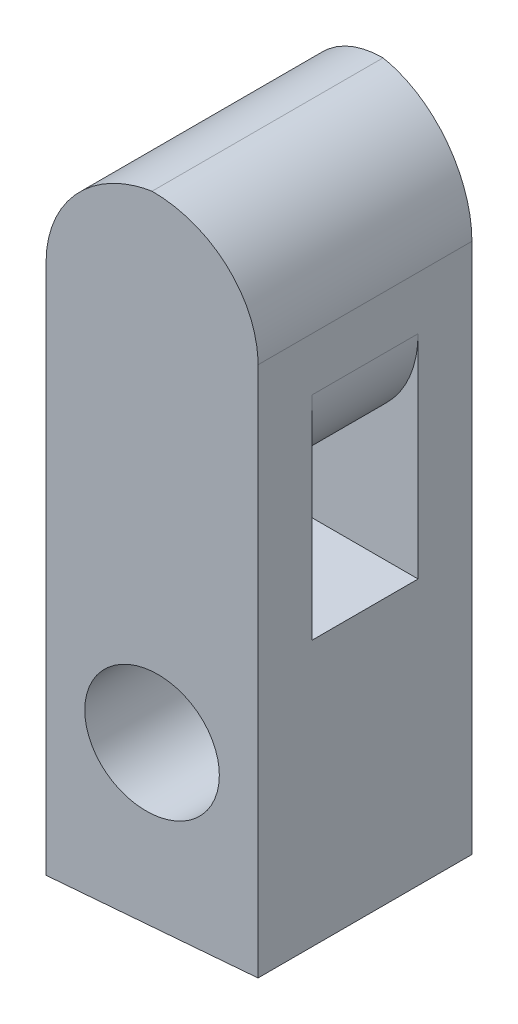
ISO-10303-21;
HEADER;
FILE_DESCRIPTION(('STEP AP214'),'2;1');
FILE_NAME('part.step','',(''),(''),'','','');
FILE_SCHEMA(('AUTOMOTIVE_DESIGN { 1 0 10303 214 1 1 1 1 }'));
ENDSEC;
DATA;
#1=APPLICATION_CONTEXT('core data for automotive mechanical design processes');
#2=APPLICATION_PROTOCOL_DEFINITION('international standard','automotive_design',2000,#1);
#3=PRODUCT_CONTEXT('',#1,'mechanical');
#4=PRODUCT('Part','Part','',(#3));
#5=PRODUCT_RELATED_PRODUCT_CATEGORY('part','',(#4));
#6=PRODUCT_DEFINITION_FORMATION('','',#4);
#7=PRODUCT_DEFINITION_CONTEXT('part definition',#1,'design');
#8=PRODUCT_DEFINITION('design','',#6,#7);
#9=PRODUCT_DEFINITION_SHAPE('','',#8);
#10=(LENGTH_UNIT() NAMED_UNIT(*) SI_UNIT(.MILLI.,.METRE.));
#11=(NAMED_UNIT(*) PLANE_ANGLE_UNIT() SI_UNIT($,.RADIAN.));
#12=(NAMED_UNIT(*) SI_UNIT($,.STERADIAN.) SOLID_ANGLE_UNIT());
#13=UNCERTAINTY_MEASURE_WITH_UNIT(LENGTH_MEASURE(1.E-05),#10,'distance_accuracy_value','');
#14=(GEOMETRIC_REPRESENTATION_CONTEXT(3) GLOBAL_UNCERTAINTY_ASSIGNED_CONTEXT((#13)) GLOBAL_UNIT_ASSIGNED_CONTEXT((#10,
#11,#12)) REPRESENTATION_CONTEXT('',''));
#15=CARTESIAN_POINT('',(0.,0.,0.));
#16=DIRECTION('',(0.,0.,1.));
#17=DIRECTION('',(1.,0.,0.));
#18=AXIS2_PLACEMENT_3D('',#15,#16,#17);
#19=CARTESIAN_POINT('',(1.835,10.,2.01391660485986));
#20=DIRECTION('',(-1.,0.,0.));
#21=DIRECTION('',(0.,0.,1.));
#22=AXIS2_PLACEMENT_3D('',#19,#20,#21);
#23=PLANE('',#22);
#24=DIRECTION('',(0.,-1.,0.));
#25=VECTOR('',#24,1.);
#26=CARTESIAN_POINT('',(1.835,5.,1.));
#27=LINE('',#26,#25);
#28=CARTESIAN_POINT('',(1.835,9.,1.));
#29=VERTEX_POINT('',#28);
#30=CARTESIAN_POINT('',(1.835,5.,1.));
#31=VERTEX_POINT('',#30);
#32=EDGE_CURVE('E138',#29,#31,#27,.T.);
#33=ORIENTED_EDGE('',*,*,#32,.F.);
#34=DIRECTION('',(0.,0.,1.));
#35=VECTOR('',#34,1.);
#36=CARTESIAN_POINT('',(1.835,9.,2.01391660485986));
#37=LINE('',#36,#35);
#38=CARTESIAN_POINT('',(1.835,9.,-1.));
#39=VERTEX_POINT('',#38);
#40=EDGE_CURVE('E189',#29,#39,#37,.F.);
#41=ORIENTED_EDGE('',*,*,#40,.T.);
#42=DIRECTION('',(0.,1.,0.));
#43=VECTOR('',#42,1.);
#44=CARTESIAN_POINT('',(1.835,5.,-1.));
#45=LINE('',#44,#43);
#46=CARTESIAN_POINT('',(1.835,5.,-1.));
#47=VERTEX_POINT('',#46);
#48=EDGE_CURVE('E144',#47,#39,#45,.T.);
#49=ORIENTED_EDGE('',*,*,#48,.F.);
#50=DIRECTION('',(0.,0.,-1.));
#51=VECTOR('',#50,1.);
#52=CARTESIAN_POINT('',(1.835,5.,1.));
#53=LINE('',#52,#51);
#54=EDGE_CURVE('E130',#31,#47,#53,.T.);
#55=ORIENTED_EDGE('',*,*,#54,.F.);
#56=EDGE_LOOP('',(#33,#41,#49,#55));
#57=FACE_BOUND('',#56,.T.);
#58=DIRECTION('',(0.,-1.,0.));
#59=VECTOR('',#58,1.);
#60=CARTESIAN_POINT('',(1.835,10.,-2.01391660485986));
#61=LINE('',#60,#59);
#62=CARTESIAN_POINT('',(1.835,10.,-2.01391660485986));
#63=VERTEX_POINT('',#62);
#64=CARTESIAN_POINT('',(1.835,0.,-2.01391660485986));
#65=VERTEX_POINT('',#64);
#66=EDGE_CURVE('E180',#63,#65,#61,.T.);
#67=ORIENTED_EDGE('',*,*,#66,.F.);
#68=DIRECTION('',(0.,0.,-1.));
#69=VECTOR('',#68,1.);
#70=CARTESIAN_POINT('',(1.835,10.,2.01391660485986));
#71=LINE('',#70,#69);
#72=CARTESIAN_POINT('',(1.835,10.,2.01391660485986));
#73=VERTEX_POINT('',#72);
#74=EDGE_CURVE('E192',#63,#73,#71,.F.);
#75=ORIENTED_EDGE('',*,*,#74,.T.);
#76=DIRECTION('',(0.,-1.,0.));
#77=VECTOR('',#76,1.);
#78=CARTESIAN_POINT('',(1.835,10.,2.01391660485986));
#79=LINE('',#78,#77);
#80=CARTESIAN_POINT('',(1.835,0.,2.01391660485986));
#81=VERTEX_POINT('',#80);
#82=EDGE_CURVE('E171',#73,#81,#79,.T.);
#83=ORIENTED_EDGE('',*,*,#82,.T.);
#84=DIRECTION('',(0.,0.,-1.));
#85=VECTOR('',#84,1.);
#86=CARTESIAN_POINT('',(1.835,0.,2.01391660485986));
#87=LINE('',#86,#85);
#88=EDGE_CURVE('E154',#81,#65,#87,.T.);
#89=ORIENTED_EDGE('',*,*,#88,.T.);
#90=EDGE_LOOP('',(#67,#75,#83,#89));
#91=FACE_BOUND('',#90,.T.);
#92=ADVANCED_FACE('F45',(#57,#91),#23,.F.);
#93=CARTESIAN_POINT('',(-1.835,10.,-2.335));
#94=DIRECTION('',(-0.0871557427476584,0.,0.996194698091746));
#95=DIRECTION('',(0.996194698091746,0.,0.0871557427476584));
#96=AXIS2_PLACEMENT_3D('',#93,#94,#95);
#97=PLANE('',#96);
#98=CARTESIAN_POINT('',(0.,3.,-2.17445830242993));
#99=DIRECTION('',(-0.0871557427476584,0.,0.996194698091746));
#100=DIRECTION('',(0.996194698091746,0.,0.0871557427476584));
#101=AXIS2_PLACEMENT_3D('',#98,#99,#100);
#102=ELLIPSE('',#101,1.169450110738,1.165);
#103=CARTESIAN_POINT('',(1.165,3.,-2.07253400942223));
#104=VERTEX_POINT('',#103);
#105=EDGE_CURVE('E222',#104,#104,#102,.T.);
#106=ORIENTED_EDGE('',*,*,#105,.T.);
#107=EDGE_LOOP('',(#106));
#108=FACE_BOUND('',#107,.T.);
#109=CARTESIAN_POINT('',(0.165000000000001,10.,-2.16002267294815));
#110=DIRECTION('',(-0.0871557427476584,0.,0.996194698091746));
#111=DIRECTION('',(-0.996194698091746,0.,-0.0871557427476584));
#112=AXIS2_PLACEMENT_3D('',#109,#110,#111);
#113=ELLIPSE('',#112,2.00763967508669,2.);
#114=CARTESIAN_POINT('',(-1.835,10.,-2.335));
#115=VERTEX_POINT('',#114);
#116=CARTESIAN_POINT('',(0.,11.9931821291593,-2.17445830242994));
#117=VERTEX_POINT('',#116);
#118=EDGE_CURVE('E183',#115,#117,#113,.F.);
#119=ORIENTED_EDGE('',*,*,#118,.T.);
#120=CARTESIAN_POINT('',(-0.165,10.,-2.18889393191171));
#121=DIRECTION('',(-0.0871557427476584,0.,0.996194698091746));
#122=DIRECTION('',(0.996194698091746,0.,0.0871557427476584));
#123=AXIS2_PLACEMENT_3D('',#120,#121,#122);
#124=ELLIPSE('',#123,2.00763967508669,2.);
#125=EDGE_CURVE('E186',#117,#63,#124,.F.);
#126=ORIENTED_EDGE('',*,*,#125,.T.);
#127=ORIENTED_EDGE('',*,*,#66,.T.);
#128=DIRECTION('',(-0.996194698091745,0.,-0.0871557427476583));
#129=VECTOR('',#128,1.);
#130=CARTESIAN_POINT('',(-1.835,0.,-2.335));
#131=LINE('',#130,#129);
#132=CARTESIAN_POINT('',(-1.835,0.,-2.335));
#133=VERTEX_POINT('',#132);
#134=EDGE_CURVE('E158',#65,#133,#131,.T.);
#135=ORIENTED_EDGE('',*,*,#134,.T.);
#136=DIRECTION('',(0.,-1.,0.));
#137=VECTOR('',#136,1.);
#138=CARTESIAN_POINT('',(-1.835,10.,-2.335));
#139=LINE('',#138,#137);
#140=EDGE_CURVE('E177',#115,#133,#139,.T.);
#141=ORIENTED_EDGE('',*,*,#140,.F.);
#142=EDGE_LOOP('',(#119,#126,#127,#135,#141));
#143=FACE_BOUND('',#142,.T.);
#144=ADVANCED_FACE('F248',(#108,#143),#97,.F.);
#145=CARTESIAN_POINT('',(-1.835,10.,2.335));
#146=DIRECTION('',(1.,0.,0.));
#147=DIRECTION('',(0.,0.,-1.));
#148=AXIS2_PLACEMENT_3D('',#145,#146,#147);
#149=PLANE('',#148);
#150=DIRECTION('',(0.,-1.,0.));
#151=VECTOR('',#150,1.);
#152=CARTESIAN_POINT('',(-1.835,5.,-1.));
#153=LINE('',#152,#151);
#154=CARTESIAN_POINT('',(-1.835,9.,-1.));
#155=VERTEX_POINT('',#154);
#156=CARTESIAN_POINT('',(-1.835,5.,-1.));
#157=VERTEX_POINT('',#156);
#158=EDGE_CURVE('E159',#155,#157,#153,.T.);
#159=ORIENTED_EDGE('',*,*,#158,.F.);
#160=DIRECTION('',(0.,0.,-1.));
#161=VECTOR('',#160,1.);
#162=CARTESIAN_POINT('',(-1.835,9.,2.335));
#163=LINE('',#162,#161);
#164=CARTESIAN_POINT('',(-1.835,9.,1.));
#165=VERTEX_POINT('',#164);
#166=EDGE_CURVE('E202',#155,#165,#163,.F.);
#167=ORIENTED_EDGE('',*,*,#166,.T.);
#168=DIRECTION('',(0.,1.,0.));
#169=VECTOR('',#168,1.);
#170=CARTESIAN_POINT('',(-1.835,5.,1.));
#171=LINE('',#170,#169);
#172=CARTESIAN_POINT('',(-1.835,5.,1.));
#173=VERTEX_POINT('',#172);
#174=EDGE_CURVE('E152',#173,#165,#171,.T.);
#175=ORIENTED_EDGE('',*,*,#174,.F.);
#176=DIRECTION('',(0.,0.,1.));
#177=VECTOR('',#176,1.);
#178=CARTESIAN_POINT('',(-1.835,5.,1.));
#179=LINE('',#178,#177);
#180=EDGE_CURVE('E133',#157,#173,#179,.T.);
#181=ORIENTED_EDGE('',*,*,#180,.F.);
#182=EDGE_LOOP('',(#159,#167,#175,#181));
#183=FACE_BOUND('',#182,.T.);
#184=DIRECTION('',(0.,-1.,0.));
#185=VECTOR('',#184,1.);
#186=CARTESIAN_POINT('',(-1.835,10.,2.335));
#187=LINE('',#186,#185);
#188=CARTESIAN_POINT('',(-1.835,10.,2.335));
#189=VERTEX_POINT('',#188);
#190=CARTESIAN_POINT('',(-1.835,0.,2.335));
#191=VERTEX_POINT('',#190);
#192=EDGE_CURVE('E174',#189,#191,#187,.T.);
#193=ORIENTED_EDGE('',*,*,#192,.F.);
#194=DIRECTION('',(0.,0.,1.));
#195=VECTOR('',#194,1.);
#196=CARTESIAN_POINT('',(-1.835,10.,-2.335));
#197=LINE('',#196,#195);
#198=EDGE_CURVE('E206',#189,#115,#197,.F.);
#199=ORIENTED_EDGE('',*,*,#198,.T.);
#200=ORIENTED_EDGE('',*,*,#140,.T.);
#201=DIRECTION('',(0.,0.,1.));
#202=VECTOR('',#201,1.);
#203=CARTESIAN_POINT('',(-1.835,0.,2.335));
#204=LINE('',#203,#202);
#205=EDGE_CURVE('E163',#133,#191,#204,.T.);
#206=ORIENTED_EDGE('',*,*,#205,.T.);
#207=EDGE_LOOP('',(#193,#199,#200,#206));
#208=FACE_BOUND('',#207,.T.);
#209=ADVANCED_FACE('F244',(#183,#208),#149,.F.);
#210=CARTESIAN_POINT('',(-1.835,10.,2.335));
#211=DIRECTION('',(-0.0871557427476584,0.,-0.996194698091746));
#212=DIRECTION('',(-0.996194698091746,0.,0.0871557427476584));
#213=AXIS2_PLACEMENT_3D('',#210,#211,#212);
#214=PLANE('',#213);
#215=CARTESIAN_POINT('',(0.,3.,2.17445830242993));
#216=DIRECTION('',(-0.0871557427476584,0.,-0.996194698091746));
#217=DIRECTION('',(-0.996194698091746,0.,0.0871557427476584));
#218=AXIS2_PLACEMENT_3D('',#215,#216,#217);
#219=ELLIPSE('',#218,1.169450110738,1.165);
#220=CARTESIAN_POINT('',(-1.165,3.,2.27638259543763));
#221=VERTEX_POINT('',#220);
#222=EDGE_CURVE('E49',#221,#221,#219,.T.);
#223=ORIENTED_EDGE('',*,*,#222,.T.);
#224=EDGE_LOOP('',(#223));
#225=FACE_BOUND('',#224,.T.);
#226=ORIENTED_EDGE('',*,*,#82,.F.);
#227=CARTESIAN_POINT('',(-0.165,10.,2.18889393191171));
#228=DIRECTION('',(-0.0871557427476584,0.,-0.996194698091746));
#229=DIRECTION('',(-0.996194698091746,0.,0.0871557427476584));
#230=AXIS2_PLACEMENT_3D('',#227,#228,#229);
#231=ELLIPSE('',#230,2.00763967508669,2.);
#232=CARTESIAN_POINT('',(0.,11.9931821291593,2.17445830242994));
#233=VERTEX_POINT('',#232);
#234=EDGE_CURVE('E199',#73,#233,#231,.F.);
#235=ORIENTED_EDGE('',*,*,#234,.T.);
#236=CARTESIAN_POINT('',(0.165000000000001,10.,2.16002267294815));
#237=DIRECTION('',(-0.0871557427476584,0.,-0.996194698091746));
#238=DIRECTION('',(0.996194698091746,0.,-0.0871557427476584));
#239=AXIS2_PLACEMENT_3D('',#236,#237,#238);
#240=ELLIPSE('',#239,2.00763967508669,2.);
#241=EDGE_CURVE('E196',#233,#189,#240,.F.);
#242=ORIENTED_EDGE('',*,*,#241,.T.);
#243=ORIENTED_EDGE('',*,*,#192,.T.);
#244=DIRECTION('',(0.996194698091745,0.,-0.0871557427476583));
#245=VECTOR('',#244,1.);
#246=CARTESIAN_POINT('',(-1.835,0.,2.335));
#247=LINE('',#246,#245);
#248=EDGE_CURVE('E167',#191,#81,#247,.T.);
#249=ORIENTED_EDGE('',*,*,#248,.T.);
#250=EDGE_LOOP('',(#226,#235,#242,#243,#249));
#251=FACE_BOUND('',#250,.T.);
#252=ADVANCED_FACE('F247',(#225,#251),#214,.F.);
#253=CARTESIAN_POINT('',(0.,0.,0.));
#254=DIRECTION('',(0.,-1.,0.));
#255=DIRECTION('',(0.,0.,-1.));
#256=AXIS2_PLACEMENT_3D('',#253,#254,#255);
#257=PLANE('',#256);
#258=ORIENTED_EDGE('',*,*,#88,.F.);
#259=ORIENTED_EDGE('',*,*,#248,.F.);
#260=ORIENTED_EDGE('',*,*,#205,.F.);
#261=ORIENTED_EDGE('',*,*,#134,.F.);
#262=EDGE_LOOP('',(#258,#259,#260,#261));
#263=FACE_BOUND('',#262,.T.);
#264=ADVANCED_FACE('F267',(#263),#257,.T.);
#265=CARTESIAN_POINT('',(-4.66342712474619,5.,-1.));
#266=DIRECTION('',(0.,0.,-1.));
#267=DIRECTION('',(-1.,0.,0.));
#268=AXIS2_PLACEMENT_3D('',#265,#266,#267);
#269=PLANE('',#268);
#270=ORIENTED_EDGE('',*,*,#158,.T.);
#271=DIRECTION('',(1.,0.,0.));
#272=VECTOR('',#271,1.);
#273=CARTESIAN_POINT('',(-4.66342712474619,5.,-1.));
#274=LINE('',#273,#272);
#275=EDGE_CURVE('E136',#157,#47,#274,.T.);
#276=ORIENTED_EDGE('',*,*,#275,.T.);
#277=ORIENTED_EDGE('',*,*,#48,.T.);
#278=CARTESIAN_POINT('',(-0.165,9.,-1.));
#279=DIRECTION('',(0.,0.,-1.));
#280=DIRECTION('',(-1.,0.,0.));
#281=AXIS2_PLACEMENT_3D('',#278,#279,#280);
#282=CIRCLE('',#281,2.);
#283=CARTESIAN_POINT('',(0.,7.0068178708407,-1.));
#284=VERTEX_POINT('',#283);
#285=EDGE_CURVE('E11',#39,#284,#282,.T.);
#286=ORIENTED_EDGE('',*,*,#285,.T.);
#287=CARTESIAN_POINT('',(0.165,9.,-1.));
#288=DIRECTION('',(0.,0.,-1.));
#289=DIRECTION('',(-1.,0.,0.));
#290=AXIS2_PLACEMENT_3D('',#287,#288,#289);
#291=CIRCLE('',#290,2.);
#292=EDGE_CURVE('E209',#284,#155,#291,.T.);
#293=ORIENTED_EDGE('',*,*,#292,.T.);
#294=EDGE_LOOP('',(#270,#276,#277,#286,#293));
#295=FACE_BOUND('',#294,.T.);
#296=ADVANCED_FACE('F239',(#295),#269,.F.);
#297=CARTESIAN_POINT('',(-4.66342712474619,5.,1.));
#298=DIRECTION('',(0.,-1.,0.));
#299=DIRECTION('',(0.,0.,-1.));
#300=AXIS2_PLACEMENT_3D('',#297,#298,#299);
#301=PLANE('',#300);
#302=ORIENTED_EDGE('',*,*,#180,.T.);
#303=DIRECTION('',(1.,0.,0.));
#304=VECTOR('',#303,1.);
#305=CARTESIAN_POINT('',(-4.66342712474619,5.,1.));
#306=LINE('',#305,#304);
#307=EDGE_CURVE('E125',#173,#31,#306,.T.);
#308=ORIENTED_EDGE('',*,*,#307,.T.);
#309=ORIENTED_EDGE('',*,*,#54,.T.);
#310=ORIENTED_EDGE('',*,*,#275,.F.);
#311=EDGE_LOOP('',(#302,#308,#309,#310));
#312=FACE_BOUND('',#311,.T.);
#313=ADVANCED_FACE('F127',(#312),#301,.F.);
#314=CARTESIAN_POINT('',(-4.66342712474619,5.,1.));
#315=DIRECTION('',(0.,0.,1.));
#316=DIRECTION('',(1.,0.,0.));
#317=AXIS2_PLACEMENT_3D('',#314,#315,#316);
#318=PLANE('',#317);
#319=ORIENTED_EDGE('',*,*,#174,.T.);
#320=CARTESIAN_POINT('',(0.165,9.,1.));
#321=DIRECTION('',(0.,0.,1.));
#322=DIRECTION('',(1.,0.,0.));
#323=AXIS2_PLACEMENT_3D('',#320,#321,#322);
#324=CIRCLE('',#323,2.);
#325=CARTESIAN_POINT('',(0.,7.0068178708407,1.));
#326=VERTEX_POINT('',#325);
#327=EDGE_CURVE('E63',#165,#326,#324,.T.);
#328=ORIENTED_EDGE('',*,*,#327,.T.);
#329=CARTESIAN_POINT('',(-0.165,9.,1.));
#330=DIRECTION('',(0.,0.,1.));
#331=DIRECTION('',(1.,0.,0.));
#332=AXIS2_PLACEMENT_3D('',#329,#330,#331);
#333=CIRCLE('',#332,2.);
#334=EDGE_CURVE('E55',#326,#29,#333,.T.);
#335=ORIENTED_EDGE('',*,*,#334,.T.);
#336=ORIENTED_EDGE('',*,*,#32,.T.);
#337=ORIENTED_EDGE('',*,*,#307,.F.);
#338=EDGE_LOOP('',(#319,#328,#335,#336,#337));
#339=FACE_BOUND('',#338,.T.);
#340=ADVANCED_FACE('F139',(#339),#318,.F.);
#341=CARTESIAN_POINT('',(0.165000000000001,10.,0.));
#342=DIRECTION('',(0.,0.,-1.));
#343=DIRECTION('',(-1.,0.,0.));
#344=AXIS2_PLACEMENT_3D('',#341,#342,#343);
#345=CYLINDRICAL_SURFACE('',#344,2.);
#346=ORIENTED_EDGE('',*,*,#198,.F.);
#347=ORIENTED_EDGE('',*,*,#241,.F.);
#348=DIRECTION('',(0.,0.,-1.));
#349=VECTOR('',#348,1.);
#350=CARTESIAN_POINT('',(0.,11.9931821291593,0.));
#351=LINE('',#350,#349);
#352=EDGE_CURVE('E216',#117,#233,#351,.F.);
#353=ORIENTED_EDGE('',*,*,#352,.F.);
#354=ORIENTED_EDGE('',*,*,#118,.F.);
#355=EDGE_LOOP('',(#346,#347,#353,#354));
#356=FACE_BOUND('',#355,.T.);
#357=ADVANCED_FACE('F259',(#356),#345,.T.);
#358=CARTESIAN_POINT('',(-0.165,10.,0.));
#359=DIRECTION('',(0.,0.,1.));
#360=DIRECTION('',(1.,0.,0.));
#361=AXIS2_PLACEMENT_3D('',#358,#359,#360);
#362=CYLINDRICAL_SURFACE('',#361,2.);
#363=ORIENTED_EDGE('',*,*,#234,.F.);
#364=ORIENTED_EDGE('',*,*,#74,.F.);
#365=ORIENTED_EDGE('',*,*,#125,.F.);
#366=ORIENTED_EDGE('',*,*,#352,.T.);
#367=EDGE_LOOP('',(#363,#364,#365,#366));
#368=FACE_BOUND('',#367,.T.);
#369=ADVANCED_FACE('F271',(#368),#362,.T.);
#370=CARTESIAN_POINT('',(-0.165,9.,1.));
#371=DIRECTION('',(0.,0.,1.));
#372=DIRECTION('',(1.,0.,0.));
#373=AXIS2_PLACEMENT_3D('',#370,#371,#372);
#374=CYLINDRICAL_SURFACE('',#373,2.);
#375=ORIENTED_EDGE('',*,*,#40,.F.);
#376=ORIENTED_EDGE('',*,*,#334,.F.);
#377=DIRECTION('',(0.,0.,1.));
#378=VECTOR('',#377,1.);
#379=CARTESIAN_POINT('',(0.,7.0068178708407,0.));
#380=LINE('',#379,#378);
#381=EDGE_CURVE('E219',#284,#326,#380,.T.);
#382=ORIENTED_EDGE('',*,*,#381,.F.);
#383=ORIENTED_EDGE('',*,*,#285,.F.);
#384=EDGE_LOOP('',(#375,#376,#382,#383));
#385=FACE_BOUND('',#384,.T.);
#386=ADVANCED_FACE('F47',(#385),#374,.T.);
#387=CARTESIAN_POINT('',(0.165,9.,1.));
#388=DIRECTION('',(0.,0.,-1.));
#389=DIRECTION('',(-1.,0.,0.));
#390=AXIS2_PLACEMENT_3D('',#387,#388,#389);
#391=CYLINDRICAL_SURFACE('',#390,2.);
#392=ORIENTED_EDGE('',*,*,#327,.F.);
#393=ORIENTED_EDGE('',*,*,#166,.F.);
#394=ORIENTED_EDGE('',*,*,#292,.F.);
#395=ORIENTED_EDGE('',*,*,#381,.T.);
#396=EDGE_LOOP('',(#392,#393,#394,#395));
#397=FACE_BOUND('',#396,.T.);
#398=ADVANCED_FACE('F242',(#397),#391,.T.);
#399=CARTESIAN_POINT('',(0.,3.,-2.335));
#400=DIRECTION('',(0.,0.,1.));
#401=DIRECTION('',(1.,0.,0.));
#402=AXIS2_PLACEMENT_3D('',#399,#400,#401);
#403=CYLINDRICAL_SURFACE('',#402,1.165);
#404=ORIENTED_EDGE('',*,*,#222,.F.);
#405=EDGE_LOOP('',(#404));
#406=FACE_BOUND('',#405,.T.);
#407=ORIENTED_EDGE('',*,*,#105,.F.);
#408=EDGE_LOOP('',(#407));
#409=FACE_BOUND('',#408,.T.);
#410=ADVANCED_FACE('F297',(#406,#409),#403,.F.);
#411=CLOSED_SHELL('',(#92,#144,#209,#252,#264,#296,#313,#340,#357,#369,#386,#398,#410));
#412=MANIFOLD_SOLID_BREP('B2',#411);
#413=ADVANCED_BREP_SHAPE_REPRESENTATION('',(#18,#412),#14);
#414=SHAPE_DEFINITION_REPRESENTATION(#9,#413);
ENDSEC;
END-ISO-10303-21;
